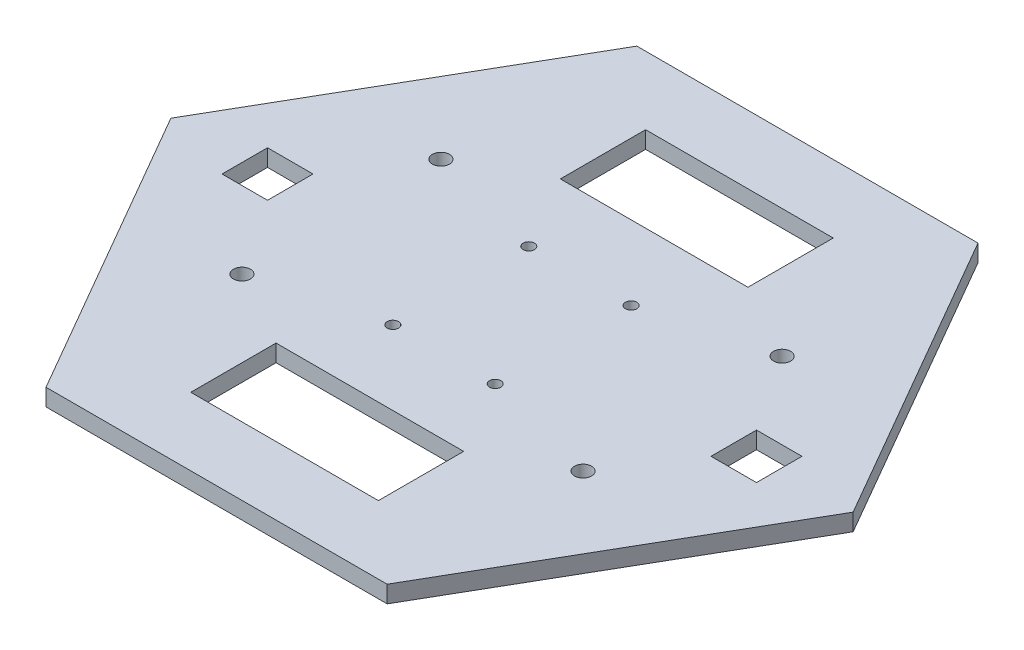
ISO-10303-21;
HEADER;
FILE_DESCRIPTION(('STEP AP214'),'2;1');
FILE_NAME('part.step','',(''),(''),'','','');
FILE_SCHEMA(('AUTOMOTIVE_DESIGN { 1 0 10303 214 1 1 1 1 }'));
ENDSEC;
DATA;
#1=APPLICATION_CONTEXT('core data for automotive mechanical design processes');
#2=APPLICATION_PROTOCOL_DEFINITION('international standard','automotive_design',2000,#1);
#3=PRODUCT_CONTEXT('',#1,'mechanical');
#4=PRODUCT('Part','Part','',(#3));
#5=PRODUCT_RELATED_PRODUCT_CATEGORY('part','',(#4));
#6=PRODUCT_DEFINITION_FORMATION('','',#4);
#7=PRODUCT_DEFINITION_CONTEXT('part definition',#1,'design');
#8=PRODUCT_DEFINITION('design','',#6,#7);
#9=PRODUCT_DEFINITION_SHAPE('','',#8);
#10=(LENGTH_UNIT() NAMED_UNIT(*) SI_UNIT(.MILLI.,.METRE.));
#11=(NAMED_UNIT(*) PLANE_ANGLE_UNIT() SI_UNIT($,.RADIAN.));
#12=(NAMED_UNIT(*) SI_UNIT($,.STERADIAN.) SOLID_ANGLE_UNIT());
#13=UNCERTAINTY_MEASURE_WITH_UNIT(LENGTH_MEASURE(1.E-05),#10,'distance_accuracy_value','');
#14=(GEOMETRIC_REPRESENTATION_CONTEXT(3) GLOBAL_UNCERTAINTY_ASSIGNED_CONTEXT((#13)) GLOBAL_UNIT_ASSIGNED_CONTEXT((#10,
#11,#12)) REPRESENTATION_CONTEXT('',''));
#15=CARTESIAN_POINT('',(0.,0.,0.));
#16=DIRECTION('',(0.,0.,1.));
#17=DIRECTION('',(1.,0.,0.));
#18=AXIS2_PLACEMENT_3D('',#15,#16,#17);
#19=CARTESIAN_POINT('',(-30.0000000000006,3.,-51.961524227066));
#20=DIRECTION('',(0.866025403784441,0.,0.499999999999995));
#21=DIRECTION('',(0.499999999999995,0.,-0.866025403784442));
#22=AXIS2_PLACEMENT_3D('',#19,#20,#21);
#23=PLANE('',#22);
#24=DIRECTION('',(-0.499999999999995,0.,0.866025403784442));
#25=VECTOR('',#24,1.);
#26=CARTESIAN_POINT('',(-30.0000000000006,0.,-51.961524227066));
#27=LINE('',#26,#25);
#28=CARTESIAN_POINT('',(-30.0000000000006,0.,-51.961524227066));
#29=VERTEX_POINT('',#28);
#30=CARTESIAN_POINT('',(-60.,0.,0.));
#31=VERTEX_POINT('',#30);
#32=EDGE_CURVE('E353',#29,#31,#27,.T.);
#33=ORIENTED_EDGE('',*,*,#32,.T.);
#34=DIRECTION('',(0.,-1.,0.));
#35=VECTOR('',#34,1.);
#36=CARTESIAN_POINT('',(-60.,3.,0.));
#37=LINE('',#36,#35);
#38=CARTESIAN_POINT('',(-60.,3.,0.));
#39=VERTEX_POINT('',#38);
#40=EDGE_CURVE('E11',#39,#31,#37,.T.);
#41=ORIENTED_EDGE('',*,*,#40,.F.);
#42=DIRECTION('',(-0.499999999999995,0.,0.866025403784442));
#43=VECTOR('',#42,1.);
#44=CARTESIAN_POINT('',(-30.0000000000006,3.,-51.961524227066));
#45=LINE('',#44,#43);
#46=CARTESIAN_POINT('',(-30.0000000000006,3.,-51.961524227066));
#47=VERTEX_POINT('',#46);
#48=EDGE_CURVE('E405',#47,#39,#45,.T.);
#49=ORIENTED_EDGE('',*,*,#48,.F.);
#50=DIRECTION('',(0.,-1.,0.));
#51=VECTOR('',#50,1.);
#52=CARTESIAN_POINT('',(-30.0000000000006,3.,-51.961524227066));
#53=LINE('',#52,#51);
#54=EDGE_CURVE('E425',#47,#29,#53,.T.);
#55=ORIENTED_EDGE('',*,*,#54,.T.);
#56=EDGE_LOOP('',(#33,#41,#49,#55));
#57=FACE_BOUND('',#56,.T.);
#58=ADVANCED_FACE('F38',(#57),#23,.F.);
#59=CARTESIAN_POINT('',(-60.,3.,0.));
#60=DIRECTION('',(0.866025403784438,0.,-0.500000000000001));
#61=DIRECTION('',(-0.500000000000001,0.,-0.866025403784438));
#62=AXIS2_PLACEMENT_3D('',#59,#60,#61);
#63=PLANE('',#62);
#64=DIRECTION('',(0.500000000000001,0.,0.866025403784438));
#65=VECTOR('',#64,1.);
#66=CARTESIAN_POINT('',(-60.,0.,0.));
#67=LINE('',#66,#65);
#68=CARTESIAN_POINT('',(-29.9999999999999,0.,51.9615242270664));
#69=VERTEX_POINT('',#68);
#70=EDGE_CURVE('E429',#31,#69,#67,.T.);
#71=ORIENTED_EDGE('',*,*,#70,.T.);
#72=DIRECTION('',(0.,-1.,0.));
#73=VECTOR('',#72,1.);
#74=CARTESIAN_POINT('',(-29.9999999999999,3.,51.9615242270664));
#75=LINE('',#74,#73);
#76=CARTESIAN_POINT('',(-29.9999999999999,3.,51.9615242270664));
#77=VERTEX_POINT('',#76);
#78=EDGE_CURVE('E46',#77,#69,#75,.T.);
#79=ORIENTED_EDGE('',*,*,#78,.F.);
#80=DIRECTION('',(0.500000000000001,0.,0.866025403784438));
#81=VECTOR('',#80,1.);
#82=CARTESIAN_POINT('',(-60.,3.,0.));
#83=LINE('',#82,#81);
#84=EDGE_CURVE('E409',#39,#77,#83,.T.);
#85=ORIENTED_EDGE('',*,*,#84,.F.);
#86=ORIENTED_EDGE('',*,*,#40,.T.);
#87=EDGE_LOOP('',(#71,#79,#85,#86));
#88=FACE_BOUND('',#87,.T.);
#89=ADVANCED_FACE('F485',(#88),#63,.F.);
#90=CARTESIAN_POINT('',(-29.9999999999999,3.,51.9615242270664));
#91=DIRECTION('',(0.,0.,-1.));
#92=DIRECTION('',(-1.,0.,0.));
#93=AXIS2_PLACEMENT_3D('',#90,#91,#92);
#94=PLANE('',#93);
#95=DIRECTION('',(1.,0.,0.));
#96=VECTOR('',#95,1.);
#97=CARTESIAN_POINT('',(-29.9999999999999,0.,51.9615242270664));
#98=LINE('',#97,#96);
#99=CARTESIAN_POINT('',(30.0000000000002,0.,51.9615242270662));
#100=VERTEX_POINT('',#99);
#101=EDGE_CURVE('E432',#69,#100,#98,.T.);
#102=ORIENTED_EDGE('',*,*,#101,.T.);
#103=DIRECTION('',(0.,-1.,0.));
#104=VECTOR('',#103,1.);
#105=CARTESIAN_POINT('',(30.0000000000002,3.,51.9615242270662));
#106=LINE('',#105,#104);
#107=CARTESIAN_POINT('',(30.0000000000002,3.,51.9615242270662));
#108=VERTEX_POINT('',#107);
#109=EDGE_CURVE('E454',#108,#100,#106,.T.);
#110=ORIENTED_EDGE('',*,*,#109,.F.);
#111=DIRECTION('',(1.,0.,0.));
#112=VECTOR('',#111,1.);
#113=CARTESIAN_POINT('',(-29.9999999999999,3.,51.9615242270664));
#114=LINE('',#113,#112);
#115=EDGE_CURVE('E413',#77,#108,#114,.T.);
#116=ORIENTED_EDGE('',*,*,#115,.F.);
#117=ORIENTED_EDGE('',*,*,#78,.T.);
#118=EDGE_LOOP('',(#102,#110,#116,#117));
#119=FACE_BOUND('',#118,.T.);
#120=ADVANCED_FACE('F463',(#119),#94,.F.);
#121=CARTESIAN_POINT('',(30.0000000000002,3.,51.9615242270662));
#122=DIRECTION('',(-0.866025403784441,0.,-0.499999999999995));
#123=DIRECTION('',(-0.499999999999995,0.,0.866025403784442));
#124=AXIS2_PLACEMENT_3D('',#121,#122,#123);
#125=PLANE('',#124);
#126=DIRECTION('',(0.499999999999995,0.,-0.866025403784442));
#127=VECTOR('',#126,1.);
#128=CARTESIAN_POINT('',(30.0000000000002,0.,51.9615242270662));
#129=LINE('',#128,#127);
#130=CARTESIAN_POINT('',(60.,0.,-4.18977760661176E-13));
#131=VERTEX_POINT('',#130);
#132=EDGE_CURVE('E435',#100,#131,#129,.T.);
#133=ORIENTED_EDGE('',*,*,#132,.T.);
#134=DIRECTION('',(0.,-1.,0.));
#135=VECTOR('',#134,1.);
#136=CARTESIAN_POINT('',(60.,3.,-4.18977760661176E-13));
#137=LINE('',#136,#135);
#138=CARTESIAN_POINT('',(60.,3.,-4.18977760661176E-13));
#139=VERTEX_POINT('',#138);
#140=EDGE_CURVE('E450',#139,#131,#137,.T.);
#141=ORIENTED_EDGE('',*,*,#140,.F.);
#142=DIRECTION('',(0.499999999999995,0.,-0.866025403784442));
#143=VECTOR('',#142,1.);
#144=CARTESIAN_POINT('',(30.0000000000002,3.,51.9615242270662));
#145=LINE('',#144,#143);
#146=EDGE_CURVE('E416',#108,#139,#145,.T.);
#147=ORIENTED_EDGE('',*,*,#146,.F.);
#148=ORIENTED_EDGE('',*,*,#109,.T.);
#149=EDGE_LOOP('',(#133,#141,#147,#148));
#150=FACE_BOUND('',#149,.T.);
#151=ADVANCED_FACE('F473',(#150),#125,.F.);
#152=CARTESIAN_POINT('',(60.,3.,-4.18977760661176E-13));
#153=DIRECTION('',(-0.866025403784435,0.,0.500000000000007));
#154=DIRECTION('',(0.500000000000007,0.,0.866025403784434));
#155=AXIS2_PLACEMENT_3D('',#152,#153,#154);
#156=PLANE('',#155);
#157=DIRECTION('',(-0.500000000000007,0.,-0.866025403784435));
#158=VECTOR('',#157,1.);
#159=CARTESIAN_POINT('',(60.,0.,-4.18977760661176E-13));
#160=LINE('',#159,#158);
#161=CARTESIAN_POINT('',(29.9999999999995,0.,-51.9615242270666));
#162=VERTEX_POINT('',#161);
#163=EDGE_CURVE('E438',#131,#162,#160,.T.);
#164=ORIENTED_EDGE('',*,*,#163,.T.);
#165=DIRECTION('',(0.,-1.,0.));
#166=VECTOR('',#165,1.);
#167=CARTESIAN_POINT('',(29.9999999999995,3.,-51.9615242270666));
#168=LINE('',#167,#166);
#169=CARTESIAN_POINT('',(29.9999999999995,3.,-51.9615242270666));
#170=VERTEX_POINT('',#169);
#171=EDGE_CURVE('E446',#170,#162,#168,.T.);
#172=ORIENTED_EDGE('',*,*,#171,.F.);
#173=DIRECTION('',(-0.500000000000007,0.,-0.866025403784435));
#174=VECTOR('',#173,1.);
#175=CARTESIAN_POINT('',(60.,3.,-4.18977760661176E-13));
#176=LINE('',#175,#174);
#177=EDGE_CURVE('E419',#139,#170,#176,.T.);
#178=ORIENTED_EDGE('',*,*,#177,.F.);
#179=ORIENTED_EDGE('',*,*,#140,.T.);
#180=EDGE_LOOP('',(#164,#172,#178,#179));
#181=FACE_BOUND('',#180,.T.);
#182=ADVANCED_FACE('F477',(#181),#156,.F.);
#183=CARTESIAN_POINT('',(29.9999999999995,3.,-51.9615242270666));
#184=DIRECTION('',(0.,0.,1.));
#185=DIRECTION('',(1.,0.,0.));
#186=AXIS2_PLACEMENT_3D('',#183,#184,#185);
#187=PLANE('',#186);
#188=DIRECTION('',(-1.,0.,0.));
#189=VECTOR('',#188,1.);
#190=CARTESIAN_POINT('',(29.9999999999995,0.,-51.9615242270666));
#191=LINE('',#190,#189);
#192=EDGE_CURVE('E410',#162,#29,#191,.T.);
#193=ORIENTED_EDGE('',*,*,#192,.T.);
#194=ORIENTED_EDGE('',*,*,#54,.F.);
#195=DIRECTION('',(-1.,0.,0.));
#196=VECTOR('',#195,1.);
#197=CARTESIAN_POINT('',(29.9999999999995,3.,-51.9615242270666));
#198=LINE('',#197,#196);
#199=EDGE_CURVE('E422',#170,#47,#198,.T.);
#200=ORIENTED_EDGE('',*,*,#199,.F.);
#201=ORIENTED_EDGE('',*,*,#171,.T.);
#202=EDGE_LOOP('',(#193,#194,#200,#201));
#203=FACE_BOUND('',#202,.T.);
#204=ADVANCED_FACE('F488',(#203),#187,.F.);
#205=CARTESIAN_POINT('',(0.,3.,0.));
#206=DIRECTION('',(0.,1.,0.));
#207=DIRECTION('',(0.,0.,1.));
#208=AXIS2_PLACEMENT_3D('',#205,#206,#207);
#209=PLANE('',#208);
#210=CARTESIAN_POINT('',(30.,3.,17.5));
#211=DIRECTION('',(0.,1.,0.));
#212=DIRECTION('',(0.,0.,1.));
#213=AXIS2_PLACEMENT_3D('',#210,#211,#212);
#214=CIRCLE('',#213,1.50000000000001);
#215=CARTESIAN_POINT('',(30.,3.,19.));
#216=VERTEX_POINT('',#215);
#217=EDGE_CURVE('E776',#216,#216,#214,.T.);
#218=ORIENTED_EDGE('',*,*,#217,.F.);
#219=EDGE_LOOP('',(#218));
#220=FACE_BOUND('',#219,.T.);
#221=CARTESIAN_POINT('',(30.,3.,-17.5));
#222=DIRECTION('',(0.,1.,0.));
#223=DIRECTION('',(0.,0.,1.));
#224=AXIS2_PLACEMENT_3D('',#221,#222,#223);
#225=CIRCLE('',#224,1.50000000000001);
#226=CARTESIAN_POINT('',(30.,3.,-16.));
#227=VERTEX_POINT('',#226);
#228=EDGE_CURVE('E780',#227,#227,#225,.T.);
#229=ORIENTED_EDGE('',*,*,#228,.F.);
#230=EDGE_LOOP('',(#229));
#231=FACE_BOUND('',#230,.T.);
#232=CARTESIAN_POINT('',(-30.,3.,-17.5));
#233=DIRECTION('',(0.,1.,0.));
#234=DIRECTION('',(0.,0.,1.));
#235=AXIS2_PLACEMENT_3D('',#232,#233,#234);
#236=CIRCLE('',#235,1.5);
#237=CARTESIAN_POINT('',(-30.,3.,-16.));
#238=VERTEX_POINT('',#237);
#239=EDGE_CURVE('E794',#238,#238,#236,.T.);
#240=ORIENTED_EDGE('',*,*,#239,.F.);
#241=EDGE_LOOP('',(#240));
#242=FACE_BOUND('',#241,.T.);
#243=CARTESIAN_POINT('',(-30.,3.,17.5));
#244=DIRECTION('',(0.,1.,0.));
#245=DIRECTION('',(0.,0.,1.));
#246=AXIS2_PLACEMENT_3D('',#243,#244,#245);
#247=CIRCLE('',#246,1.5);
#248=CARTESIAN_POINT('',(-30.,3.,19.));
#249=VERTEX_POINT('',#248);
#250=EDGE_CURVE('E218',#249,#249,#247,.T.);
#251=ORIENTED_EDGE('',*,*,#250,.F.);
#252=EDGE_LOOP('',(#251));
#253=FACE_BOUND('',#252,.T.);
#254=DIRECTION('',(0.,0.,-1.));
#255=VECTOR('',#254,1.);
#256=CARTESIAN_POINT('',(-39.,3.,-3.99999999999999));
#257=LINE('',#256,#255);
#258=CARTESIAN_POINT('',(-39.,3.,4.00000000000001));
#259=VERTEX_POINT('',#258);
#260=CARTESIAN_POINT('',(-39.,3.,-3.99999999999999));
#261=VERTEX_POINT('',#260);
#262=EDGE_CURVE('E53',#259,#261,#257,.T.);
#263=ORIENTED_EDGE('',*,*,#262,.F.);
#264=DIRECTION('',(1.,0.,0.));
#265=VECTOR('',#264,1.);
#266=CARTESIAN_POINT('',(-47.,3.,4.00000000000001));
#267=LINE('',#266,#265);
#268=CARTESIAN_POINT('',(-47.,3.,4.00000000000001));
#269=VERTEX_POINT('',#268);
#270=EDGE_CURVE('E211',#269,#259,#267,.T.);
#271=ORIENTED_EDGE('',*,*,#270,.F.);
#272=DIRECTION('',(0.,0.,1.));
#273=VECTOR('',#272,1.);
#274=CARTESIAN_POINT('',(-47.,3.,-3.99999999999999));
#275=LINE('',#274,#273);
#276=CARTESIAN_POINT('',(-47.,3.,-3.99999999999999));
#277=VERTEX_POINT('',#276);
#278=EDGE_CURVE('E215',#277,#269,#275,.T.);
#279=ORIENTED_EDGE('',*,*,#278,.F.);
#280=DIRECTION('',(-1.,0.,0.));
#281=VECTOR('',#280,1.);
#282=CARTESIAN_POINT('',(-47.,3.,-3.99999999999999));
#283=LINE('',#282,#281);
#284=EDGE_CURVE('E227',#261,#277,#283,.T.);
#285=ORIENTED_EDGE('',*,*,#284,.F.);
#286=EDGE_LOOP('',(#263,#271,#279,#285));
#287=FACE_BOUND('',#286,.T.);
#288=DIRECTION('',(0.,0.,-1.));
#289=VECTOR('',#288,1.);
#290=CARTESIAN_POINT('',(47.,3.,-3.99999999999999));
#291=LINE('',#290,#289);
#292=CARTESIAN_POINT('',(47.,3.,4.00000000000001));
#293=VERTEX_POINT('',#292);
#294=CARTESIAN_POINT('',(47.,3.,-3.99999999999999));
#295=VERTEX_POINT('',#294);
#296=EDGE_CURVE('E61',#293,#295,#291,.T.);
#297=ORIENTED_EDGE('',*,*,#296,.F.);
#298=DIRECTION('',(1.,0.,0.));
#299=VECTOR('',#298,1.);
#300=CARTESIAN_POINT('',(47.,3.,4.00000000000001));
#301=LINE('',#300,#299);
#302=CARTESIAN_POINT('',(39.,3.,4.00000000000001));
#303=VERTEX_POINT('',#302);
#304=EDGE_CURVE('E248',#303,#293,#301,.T.);
#305=ORIENTED_EDGE('',*,*,#304,.F.);
#306=DIRECTION('',(0.,0.,1.));
#307=VECTOR('',#306,1.);
#308=CARTESIAN_POINT('',(39.,3.,-3.99999999999999));
#309=LINE('',#308,#307);
#310=CARTESIAN_POINT('',(39.,3.,-3.99999999999999));
#311=VERTEX_POINT('',#310);
#312=EDGE_CURVE('E268',#311,#303,#309,.T.);
#313=ORIENTED_EDGE('',*,*,#312,.F.);
#314=DIRECTION('',(-1.,0.,0.));
#315=VECTOR('',#314,1.);
#316=CARTESIAN_POINT('',(47.,3.,-3.99999999999999));
#317=LINE('',#316,#315);
#318=EDGE_CURVE('E263',#295,#311,#317,.T.);
#319=ORIENTED_EDGE('',*,*,#318,.F.);
#320=EDGE_LOOP('',(#297,#305,#313,#319));
#321=FACE_BOUND('',#320,.T.);
#322=CARTESIAN_POINT('',(-9.,3.,-11.95));
#323=DIRECTION('',(0.,1.,0.));
#324=DIRECTION('',(0.,0.,-1.));
#325=AXIS2_PLACEMENT_3D('',#322,#323,#324);
#326=CIRCLE('',#325,1.);
#327=CARTESIAN_POINT('',(-9.,3.,-12.95));
#328=VERTEX_POINT('',#327);
#329=EDGE_CURVE('E237',#328,#328,#326,.T.);
#330=ORIENTED_EDGE('',*,*,#329,.F.);
#331=EDGE_LOOP('',(#330));
#332=FACE_BOUND('',#331,.T.);
#333=CARTESIAN_POINT('',(9.,3.,-11.95));
#334=DIRECTION('',(0.,1.,0.));
#335=DIRECTION('',(0.,0.,-1.));
#336=AXIS2_PLACEMENT_3D('',#333,#334,#335);
#337=CIRCLE('',#336,1.);
#338=CARTESIAN_POINT('',(9.,3.,-12.95));
#339=VERTEX_POINT('',#338);
#340=EDGE_CURVE('E298',#339,#339,#337,.T.);
#341=ORIENTED_EDGE('',*,*,#340,.F.);
#342=EDGE_LOOP('',(#341));
#343=FACE_BOUND('',#342,.T.);
#344=CARTESIAN_POINT('',(9.,3.,11.95));
#345=DIRECTION('',(0.,1.,0.));
#346=DIRECTION('',(0.,0.,1.));
#347=AXIS2_PLACEMENT_3D('',#344,#345,#346);
#348=CIRCLE('',#347,1.);
#349=CARTESIAN_POINT('',(9.,3.,12.95));
#350=VERTEX_POINT('',#349);
#351=EDGE_CURVE('E290',#350,#350,#348,.T.);
#352=ORIENTED_EDGE('',*,*,#351,.F.);
#353=EDGE_LOOP('',(#352));
#354=FACE_BOUND('',#353,.T.);
#355=CARTESIAN_POINT('',(-9.,3.,11.95));
#356=DIRECTION('',(0.,1.,0.));
#357=DIRECTION('',(0.,0.,1.));
#358=AXIS2_PLACEMENT_3D('',#355,#356,#357);
#359=CIRCLE('',#358,1.);
#360=CARTESIAN_POINT('',(-9.,3.,12.95));
#361=VERTEX_POINT('',#360);
#362=EDGE_CURVE('E289',#361,#361,#359,.T.);
#363=ORIENTED_EDGE('',*,*,#362,.F.);
#364=EDGE_LOOP('',(#363));
#365=FACE_BOUND('',#364,.T.);
#366=DIRECTION('',(0.,0.,-1.));
#367=VECTOR('',#366,1.);
#368=CARTESIAN_POINT('',(16.5,3.,25.));
#369=LINE('',#368,#367);
#370=CARTESIAN_POINT('',(16.5,3.,40.));
#371=VERTEX_POINT('',#370);
#372=CARTESIAN_POINT('',(16.5,3.,25.));
#373=VERTEX_POINT('',#372);
#374=EDGE_CURVE('E335',#371,#373,#369,.T.);
#375=ORIENTED_EDGE('',*,*,#374,.F.);
#376=DIRECTION('',(1.,0.,0.));
#377=VECTOR('',#376,1.);
#378=CARTESIAN_POINT('',(-16.5,3.,40.));
#379=LINE('',#378,#377);
#380=CARTESIAN_POINT('',(-16.5,3.,40.));
#381=VERTEX_POINT('',#380);
#382=EDGE_CURVE('E322',#381,#371,#379,.T.);
#383=ORIENTED_EDGE('',*,*,#382,.F.);
#384=DIRECTION('',(0.,0.,1.));
#385=VECTOR('',#384,1.);
#386=CARTESIAN_POINT('',(-16.5,3.,25.));
#387=LINE('',#386,#385);
#388=CARTESIAN_POINT('',(-16.5,3.,25.));
#389=VERTEX_POINT('',#388);
#390=EDGE_CURVE('E343',#389,#381,#387,.T.);
#391=ORIENTED_EDGE('',*,*,#390,.F.);
#392=DIRECTION('',(-1.,0.,0.));
#393=VECTOR('',#392,1.);
#394=CARTESIAN_POINT('',(-16.5,3.,25.));
#395=LINE('',#394,#393);
#396=EDGE_CURVE('E338',#373,#389,#395,.T.);
#397=ORIENTED_EDGE('',*,*,#396,.F.);
#398=EDGE_LOOP('',(#375,#383,#391,#397));
#399=FACE_BOUND('',#398,.T.);
#400=DIRECTION('',(0.,0.,-1.));
#401=VECTOR('',#400,1.);
#402=CARTESIAN_POINT('',(16.5,3.,-40.));
#403=LINE('',#402,#401);
#404=CARTESIAN_POINT('',(16.5,3.,-25.));
#405=VERTEX_POINT('',#404);
#406=CARTESIAN_POINT('',(16.5,3.,-40.));
#407=VERTEX_POINT('',#406);
#408=EDGE_CURVE('E313',#405,#407,#403,.T.);
#409=ORIENTED_EDGE('',*,*,#408,.F.);
#410=DIRECTION('',(1.,0.,0.));
#411=VECTOR('',#410,1.);
#412=CARTESIAN_POINT('',(-16.5,3.,-25.));
#413=LINE('',#412,#411);
#414=CARTESIAN_POINT('',(-16.5,3.,-25.));
#415=VERTEX_POINT('',#414);
#416=EDGE_CURVE('E368',#415,#405,#413,.T.);
#417=ORIENTED_EDGE('',*,*,#416,.F.);
#418=DIRECTION('',(0.,0.,1.));
#419=VECTOR('',#418,1.);
#420=CARTESIAN_POINT('',(-16.5,3.,-40.));
#421=LINE('',#420,#419);
#422=CARTESIAN_POINT('',(-16.5,3.,-40.));
#423=VERTEX_POINT('',#422);
#424=EDGE_CURVE('E387',#423,#415,#421,.T.);
#425=ORIENTED_EDGE('',*,*,#424,.F.);
#426=DIRECTION('',(-1.,0.,0.));
#427=VECTOR('',#426,1.);
#428=CARTESIAN_POINT('',(-16.5,3.,-40.));
#429=LINE('',#428,#427);
#430=EDGE_CURVE('E383',#407,#423,#429,.T.);
#431=ORIENTED_EDGE('',*,*,#430,.F.);
#432=EDGE_LOOP('',(#409,#417,#425,#431));
#433=FACE_BOUND('',#432,.T.);
#434=ORIENTED_EDGE('',*,*,#48,.T.);
#435=ORIENTED_EDGE('',*,*,#84,.T.);
#436=ORIENTED_EDGE('',*,*,#115,.T.);
#437=ORIENTED_EDGE('',*,*,#146,.T.);
#438=ORIENTED_EDGE('',*,*,#177,.T.);
#439=ORIENTED_EDGE('',*,*,#199,.T.);
#440=EDGE_LOOP('',(#434,#435,#436,#437,#438,#439));
#441=FACE_BOUND('',#440,.T.);
#442=ADVANCED_FACE('F481',(#220,#231,#242,#253,#287,#321,#332,#343,#354,#365,#399,#433,#441),
#209,.T.);
#443=CARTESIAN_POINT('',(0.,0.,0.));
#444=DIRECTION('',(0.,1.,0.));
#445=DIRECTION('',(0.,0.,1.));
#446=AXIS2_PLACEMENT_3D('',#443,#444,#445);
#447=PLANE('',#446);
#448=CARTESIAN_POINT('',(30.,0.,17.5));
#449=DIRECTION('',(0.,1.,0.));
#450=DIRECTION('',(0.,0.,1.));
#451=AXIS2_PLACEMENT_3D('',#448,#449,#450);
#452=CIRCLE('',#451,1.50000000000001);
#453=CARTESIAN_POINT('',(30.,0.,19.));
#454=VERTEX_POINT('',#453);
#455=EDGE_CURVE('E773',#454,#454,#452,.T.);
#456=ORIENTED_EDGE('',*,*,#455,.T.);
#457=EDGE_LOOP('',(#456));
#458=FACE_BOUND('',#457,.T.);
#459=CARTESIAN_POINT('',(30.,0.,-17.5));
#460=DIRECTION('',(0.,1.,0.));
#461=DIRECTION('',(0.,0.,1.));
#462=AXIS2_PLACEMENT_3D('',#459,#460,#461);
#463=CIRCLE('',#462,1.50000000000001);
#464=CARTESIAN_POINT('',(30.,0.,-16.));
#465=VERTEX_POINT('',#464);
#466=EDGE_CURVE('E800',#465,#465,#463,.T.);
#467=ORIENTED_EDGE('',*,*,#466,.T.);
#468=EDGE_LOOP('',(#467));
#469=FACE_BOUND('',#468,.T.);
#470=CARTESIAN_POINT('',(-30.,0.,-17.5));
#471=DIRECTION('',(0.,1.,0.));
#472=DIRECTION('',(0.,0.,1.));
#473=AXIS2_PLACEMENT_3D('',#470,#471,#472);
#474=CIRCLE('',#473,1.5);
#475=CARTESIAN_POINT('',(-30.,0.,-16.));
#476=VERTEX_POINT('',#475);
#477=EDGE_CURVE('E789',#476,#476,#474,.T.);
#478=ORIENTED_EDGE('',*,*,#477,.T.);
#479=EDGE_LOOP('',(#478));
#480=FACE_BOUND('',#479,.T.);
#481=CARTESIAN_POINT('',(-30.,0.,17.5));
#482=DIRECTION('',(0.,1.,0.));
#483=DIRECTION('',(0.,0.,1.));
#484=AXIS2_PLACEMENT_3D('',#481,#482,#483);
#485=CIRCLE('',#484,1.5);
#486=CARTESIAN_POINT('',(-30.,0.,19.));
#487=VERTEX_POINT('',#486);
#488=EDGE_CURVE('E264',#487,#487,#485,.T.);
#489=ORIENTED_EDGE('',*,*,#488,.T.);
#490=EDGE_LOOP('',(#489));
#491=FACE_BOUND('',#490,.T.);
#492=DIRECTION('',(1.,0.,0.));
#493=VECTOR('',#492,1.);
#494=CARTESIAN_POINT('',(-47.,0.,4.00000000000001));
#495=LINE('',#494,#493);
#496=CARTESIAN_POINT('',(-47.,0.,4.00000000000001));
#497=VERTEX_POINT('',#496);
#498=CARTESIAN_POINT('',(-39.,0.,4.00000000000001));
#499=VERTEX_POINT('',#498);
#500=EDGE_CURVE('E196',#497,#499,#495,.T.);
#501=ORIENTED_EDGE('',*,*,#500,.T.);
#502=DIRECTION('',(0.,0.,-1.));
#503=VECTOR('',#502,1.);
#504=CARTESIAN_POINT('',(-39.,0.,-3.99999999999999));
#505=LINE('',#504,#503);
#506=CARTESIAN_POINT('',(-39.,0.,-3.99999999999999));
#507=VERTEX_POINT('',#506);
#508=EDGE_CURVE('E189',#499,#507,#505,.T.);
#509=ORIENTED_EDGE('',*,*,#508,.T.);
#510=DIRECTION('',(-1.,0.,0.));
#511=VECTOR('',#510,1.);
#512=CARTESIAN_POINT('',(-47.,0.,-3.99999999999999));
#513=LINE('',#512,#511);
#514=CARTESIAN_POINT('',(-47.,0.,-3.99999999999999));
#515=VERTEX_POINT('',#514);
#516=EDGE_CURVE('E200',#507,#515,#513,.T.);
#517=ORIENTED_EDGE('',*,*,#516,.T.);
#518=DIRECTION('',(0.,0.,1.));
#519=VECTOR('',#518,1.);
#520=CARTESIAN_POINT('',(-47.,0.,-3.99999999999999));
#521=LINE('',#520,#519);
#522=EDGE_CURVE('E205',#515,#497,#521,.T.);
#523=ORIENTED_EDGE('',*,*,#522,.T.);
#524=EDGE_LOOP('',(#501,#509,#517,#523));
#525=FACE_BOUND('',#524,.T.);
#526=DIRECTION('',(1.,0.,0.));
#527=VECTOR('',#526,1.);
#528=CARTESIAN_POINT('',(47.,0.,4.00000000000001));
#529=LINE('',#528,#527);
#530=CARTESIAN_POINT('',(39.,0.,4.00000000000001));
#531=VERTEX_POINT('',#530);
#532=CARTESIAN_POINT('',(47.,0.,4.00000000000001));
#533=VERTEX_POINT('',#532);
#534=EDGE_CURVE('E256',#531,#533,#529,.T.);
#535=ORIENTED_EDGE('',*,*,#534,.T.);
#536=DIRECTION('',(0.,0.,-1.));
#537=VECTOR('',#536,1.);
#538=CARTESIAN_POINT('',(47.,0.,-3.99999999999999));
#539=LINE('',#538,#537);
#540=CARTESIAN_POINT('',(47.,0.,-3.99999999999999));
#541=VERTEX_POINT('',#540);
#542=EDGE_CURVE('E243',#533,#541,#539,.T.);
#543=ORIENTED_EDGE('',*,*,#542,.T.);
#544=DIRECTION('',(-1.,0.,0.));
#545=VECTOR('',#544,1.);
#546=CARTESIAN_POINT('',(47.,0.,-3.99999999999999));
#547=LINE('',#546,#545);
#548=CARTESIAN_POINT('',(39.,0.,-3.99999999999999));
#549=VERTEX_POINT('',#548);
#550=EDGE_CURVE('E247',#541,#549,#547,.T.);
#551=ORIENTED_EDGE('',*,*,#550,.T.);
#552=DIRECTION('',(0.,0.,1.));
#553=VECTOR('',#552,1.);
#554=CARTESIAN_POINT('',(39.,0.,-3.99999999999999));
#555=LINE('',#554,#553);
#556=EDGE_CURVE('E252',#549,#531,#555,.T.);
#557=ORIENTED_EDGE('',*,*,#556,.T.);
#558=EDGE_LOOP('',(#535,#543,#551,#557));
#559=FACE_BOUND('',#558,.T.);
#560=CARTESIAN_POINT('',(-9.,0.,-11.95));
#561=DIRECTION('',(0.,1.,0.));
#562=DIRECTION('',(0.,0.,-1.));
#563=AXIS2_PLACEMENT_3D('',#560,#561,#562);
#564=CIRCLE('',#563,1.);
#565=CARTESIAN_POINT('',(-9.,0.,-12.95));
#566=VERTEX_POINT('',#565);
#567=EDGE_CURVE('E302',#566,#566,#564,.T.);
#568=ORIENTED_EDGE('',*,*,#567,.T.);
#569=EDGE_LOOP('',(#568));
#570=FACE_BOUND('',#569,.T.);
#571=CARTESIAN_POINT('',(9.,0.,-11.95));
#572=DIRECTION('',(0.,1.,0.));
#573=DIRECTION('',(0.,0.,-1.));
#574=AXIS2_PLACEMENT_3D('',#571,#572,#573);
#575=CIRCLE('',#574,1.);
#576=CARTESIAN_POINT('',(9.,0.,-12.95));
#577=VERTEX_POINT('',#576);
#578=EDGE_CURVE('E294',#577,#577,#575,.T.);
#579=ORIENTED_EDGE('',*,*,#578,.T.);
#580=EDGE_LOOP('',(#579));
#581=FACE_BOUND('',#580,.T.);
#582=CARTESIAN_POINT('',(9.,0.,11.95));
#583=DIRECTION('',(0.,1.,0.));
#584=DIRECTION('',(0.,0.,1.));
#585=AXIS2_PLACEMENT_3D('',#582,#583,#584);
#586=CIRCLE('',#585,1.);
#587=CARTESIAN_POINT('',(9.,0.,12.95));
#588=VERTEX_POINT('',#587);
#589=EDGE_CURVE('E285',#588,#588,#586,.T.);
#590=ORIENTED_EDGE('',*,*,#589,.T.);
#591=EDGE_LOOP('',(#590));
#592=FACE_BOUND('',#591,.T.);
#593=CARTESIAN_POINT('',(-9.,0.,11.95));
#594=DIRECTION('',(0.,1.,0.));
#595=DIRECTION('',(0.,0.,1.));
#596=AXIS2_PLACEMENT_3D('',#593,#594,#595);
#597=CIRCLE('',#596,1.);
#598=CARTESIAN_POINT('',(-9.,0.,12.95));
#599=VERTEX_POINT('',#598);
#600=EDGE_CURVE('E309',#599,#599,#597,.T.);
#601=ORIENTED_EDGE('',*,*,#600,.T.);
#602=EDGE_LOOP('',(#601));
#603=FACE_BOUND('',#602,.T.);
#604=DIRECTION('',(1.,0.,0.));
#605=VECTOR('',#604,1.);
#606=CARTESIAN_POINT('',(-16.5,0.,40.));
#607=LINE('',#606,#605);
#608=CARTESIAN_POINT('',(-16.5,0.,40.));
#609=VERTEX_POINT('',#608);
#610=CARTESIAN_POINT('',(16.5,0.,40.));
#611=VERTEX_POINT('',#610);
#612=EDGE_CURVE('E330',#609,#611,#607,.T.);
#613=ORIENTED_EDGE('',*,*,#612,.T.);
#614=DIRECTION('',(0.,0.,-1.));
#615=VECTOR('',#614,1.);
#616=CARTESIAN_POINT('',(16.5,0.,25.));
#617=LINE('',#616,#615);
#618=CARTESIAN_POINT('',(16.5,0.,25.));
#619=VERTEX_POINT('',#618);
#620=EDGE_CURVE('E317',#611,#619,#617,.T.);
#621=ORIENTED_EDGE('',*,*,#620,.T.);
#622=DIRECTION('',(-1.,0.,0.));
#623=VECTOR('',#622,1.);
#624=CARTESIAN_POINT('',(-16.5,0.,25.));
#625=LINE('',#624,#623);
#626=CARTESIAN_POINT('',(-16.5,0.,25.));
#627=VERTEX_POINT('',#626);
#628=EDGE_CURVE('E321',#619,#627,#625,.T.);
#629=ORIENTED_EDGE('',*,*,#628,.T.);
#630=DIRECTION('',(0.,0.,1.));
#631=VECTOR('',#630,1.);
#632=CARTESIAN_POINT('',(-16.5,0.,25.));
#633=LINE('',#632,#631);
#634=EDGE_CURVE('E326',#627,#609,#633,.T.);
#635=ORIENTED_EDGE('',*,*,#634,.T.);
#636=EDGE_LOOP('',(#613,#621,#629,#635));
#637=FACE_BOUND('',#636,.T.);
#638=DIRECTION('',(1.,0.,0.));
#639=VECTOR('',#638,1.);
#640=CARTESIAN_POINT('',(-16.5,0.,-25.));
#641=LINE('',#640,#639);
#642=CARTESIAN_POINT('',(-16.5,0.,-25.));
#643=VERTEX_POINT('',#642);
#644=CARTESIAN_POINT('',(16.5,0.,-25.));
#645=VERTEX_POINT('',#644);
#646=EDGE_CURVE('E376',#643,#645,#641,.T.);
#647=ORIENTED_EDGE('',*,*,#646,.T.);
#648=DIRECTION('',(0.,0.,-1.));
#649=VECTOR('',#648,1.);
#650=CARTESIAN_POINT('',(16.5,0.,-40.));
#651=LINE('',#650,#649);
#652=CARTESIAN_POINT('',(16.5,0.,-40.));
#653=VERTEX_POINT('',#652);
#654=EDGE_CURVE('E363',#645,#653,#651,.T.);
#655=ORIENTED_EDGE('',*,*,#654,.T.);
#656=DIRECTION('',(-1.,0.,0.));
#657=VECTOR('',#656,1.);
#658=CARTESIAN_POINT('',(-16.5,0.,-40.));
#659=LINE('',#658,#657);
#660=CARTESIAN_POINT('',(-16.5,0.,-40.));
#661=VERTEX_POINT('',#660);
#662=EDGE_CURVE('E367',#653,#661,#659,.T.);
#663=ORIENTED_EDGE('',*,*,#662,.T.);
#664=DIRECTION('',(0.,0.,1.));
#665=VECTOR('',#664,1.);
#666=CARTESIAN_POINT('',(-16.5,0.,-40.));
#667=LINE('',#666,#665);
#668=EDGE_CURVE('E372',#661,#643,#667,.T.);
#669=ORIENTED_EDGE('',*,*,#668,.T.);
#670=EDGE_LOOP('',(#647,#655,#663,#669));
#671=FACE_BOUND('',#670,.T.);
#672=ORIENTED_EDGE('',*,*,#32,.F.);
#673=ORIENTED_EDGE('',*,*,#192,.F.);
#674=ORIENTED_EDGE('',*,*,#163,.F.);
#675=ORIENTED_EDGE('',*,*,#132,.F.);
#676=ORIENTED_EDGE('',*,*,#101,.F.);
#677=ORIENTED_EDGE('',*,*,#70,.F.);
#678=EDGE_LOOP('',(#672,#673,#674,#675,#676,#677));
#679=FACE_BOUND('',#678,.T.);
#680=ADVANCED_FACE('F207',(#458,#469,#480,#491,#525,#559,#570,#581,#592,#603,#637,#671,#679),
#447,.F.);
#681=CARTESIAN_POINT('',(16.5,0.,-40.));
#682=DIRECTION('',(1.,0.,0.));
#683=DIRECTION('',(0.,0.,-1.));
#684=AXIS2_PLACEMENT_3D('',#681,#682,#683);
#685=PLANE('',#684);
#686=ORIENTED_EDGE('',*,*,#408,.T.);
#687=DIRECTION('',(0.,1.,0.));
#688=VECTOR('',#687,1.);
#689=CARTESIAN_POINT('',(16.5,0.,-40.));
#690=LINE('',#689,#688);
#691=EDGE_CURVE('E380',#653,#407,#690,.T.);
#692=ORIENTED_EDGE('',*,*,#691,.F.);
#693=ORIENTED_EDGE('',*,*,#654,.F.);
#694=DIRECTION('',(0.,1.,0.));
#695=VECTOR('',#694,1.);
#696=CARTESIAN_POINT('',(16.5,0.,-25.));
#697=LINE('',#696,#695);
#698=EDGE_CURVE('E339',#645,#405,#697,.T.);
#699=ORIENTED_EDGE('',*,*,#698,.T.);
#700=EDGE_LOOP('',(#686,#692,#693,#699));
#701=FACE_BOUND('',#700,.T.);
#702=ADVANCED_FACE('F528',(#701),#685,.F.);
#703=CARTESIAN_POINT('',(-16.5,0.,-25.));
#704=DIRECTION('',(0.,0.,1.));
#705=DIRECTION('',(1.,0.,0.));
#706=AXIS2_PLACEMENT_3D('',#703,#704,#705);
#707=PLANE('',#706);
#708=ORIENTED_EDGE('',*,*,#416,.T.);
#709=ORIENTED_EDGE('',*,*,#698,.F.);
#710=ORIENTED_EDGE('',*,*,#646,.F.);
#711=DIRECTION('',(0.,1.,0.));
#712=VECTOR('',#711,1.);
#713=CARTESIAN_POINT('',(-16.5,0.,-25.));
#714=LINE('',#713,#712);
#715=EDGE_CURVE('E396',#643,#415,#714,.T.);
#716=ORIENTED_EDGE('',*,*,#715,.T.);
#717=EDGE_LOOP('',(#708,#709,#710,#716));
#718=FACE_BOUND('',#717,.T.);
#719=ADVANCED_FACE('F533',(#718),#707,.F.);
#720=CARTESIAN_POINT('',(-16.5,0.,-40.));
#721=DIRECTION('',(-1.,0.,0.));
#722=DIRECTION('',(0.,0.,1.));
#723=AXIS2_PLACEMENT_3D('',#720,#721,#722);
#724=PLANE('',#723);
#725=ORIENTED_EDGE('',*,*,#424,.T.);
#726=ORIENTED_EDGE('',*,*,#715,.F.);
#727=ORIENTED_EDGE('',*,*,#668,.F.);
#728=DIRECTION('',(0.,1.,0.));
#729=VECTOR('',#728,1.);
#730=CARTESIAN_POINT('',(-16.5,0.,-40.));
#731=LINE('',#730,#729);
#732=EDGE_CURVE('E399',#661,#423,#731,.T.);
#733=ORIENTED_EDGE('',*,*,#732,.T.);
#734=EDGE_LOOP('',(#725,#726,#727,#733));
#735=FACE_BOUND('',#734,.T.);
#736=ADVANCED_FACE('F545',(#735),#724,.F.);
#737=CARTESIAN_POINT('',(-16.5,0.,-40.));
#738=DIRECTION('',(0.,0.,-1.));
#739=DIRECTION('',(-1.,0.,0.));
#740=AXIS2_PLACEMENT_3D('',#737,#738,#739);
#741=PLANE('',#740);
#742=ORIENTED_EDGE('',*,*,#430,.T.);
#743=ORIENTED_EDGE('',*,*,#732,.F.);
#744=ORIENTED_EDGE('',*,*,#662,.F.);
#745=ORIENTED_EDGE('',*,*,#691,.T.);
#746=EDGE_LOOP('',(#742,#743,#744,#745));
#747=FACE_BOUND('',#746,.T.);
#748=ADVANCED_FACE('F555',(#747),#741,.F.);
#749=CARTESIAN_POINT('',(16.5,0.,25.));
#750=DIRECTION('',(1.,0.,0.));
#751=DIRECTION('',(0.,0.,-1.));
#752=AXIS2_PLACEMENT_3D('',#749,#750,#751);
#753=PLANE('',#752);
#754=ORIENTED_EDGE('',*,*,#374,.T.);
#755=DIRECTION('',(0.,1.,0.));
#756=VECTOR('',#755,1.);
#757=CARTESIAN_POINT('',(16.5,0.,25.));
#758=LINE('',#757,#756);
#759=EDGE_CURVE('E334',#619,#373,#758,.T.);
#760=ORIENTED_EDGE('',*,*,#759,.F.);
#761=ORIENTED_EDGE('',*,*,#620,.F.);
#762=DIRECTION('',(0.,1.,0.));
#763=VECTOR('',#762,1.);
#764=CARTESIAN_POINT('',(16.5,0.,40.));
#765=LINE('',#764,#763);
#766=EDGE_CURVE('E350',#611,#371,#765,.T.);
#767=ORIENTED_EDGE('',*,*,#766,.T.);
#768=EDGE_LOOP('',(#754,#760,#761,#767));
#769=FACE_BOUND('',#768,.T.);
#770=ADVANCED_FACE('F565',(#769),#753,.F.);
#771=CARTESIAN_POINT('',(-16.5,0.,40.));
#772=DIRECTION('',(0.,0.,1.));
#773=DIRECTION('',(1.,0.,0.));
#774=AXIS2_PLACEMENT_3D('',#771,#772,#773);
#775=PLANE('',#774);
#776=ORIENTED_EDGE('',*,*,#382,.T.);
#777=ORIENTED_EDGE('',*,*,#766,.F.);
#778=ORIENTED_EDGE('',*,*,#612,.F.);
#779=DIRECTION('',(0.,1.,0.));
#780=VECTOR('',#779,1.);
#781=CARTESIAN_POINT('',(-16.5,0.,40.));
#782=LINE('',#781,#780);
#783=EDGE_CURVE('E354',#609,#381,#782,.T.);
#784=ORIENTED_EDGE('',*,*,#783,.T.);
#785=EDGE_LOOP('',(#776,#777,#778,#784));
#786=FACE_BOUND('',#785,.T.);
#787=ADVANCED_FACE('F575',(#786),#775,.F.);
#788=CARTESIAN_POINT('',(-16.5,0.,25.));
#789=DIRECTION('',(-1.,0.,0.));
#790=DIRECTION('',(0.,0.,1.));
#791=AXIS2_PLACEMENT_3D('',#788,#789,#790);
#792=PLANE('',#791);
#793=ORIENTED_EDGE('',*,*,#390,.T.);
#794=ORIENTED_EDGE('',*,*,#783,.F.);
#795=ORIENTED_EDGE('',*,*,#634,.F.);
#796=DIRECTION('',(0.,1.,0.));
#797=VECTOR('',#796,1.);
#798=CARTESIAN_POINT('',(-16.5,0.,25.));
#799=LINE('',#798,#797);
#800=EDGE_CURVE('E357',#627,#389,#799,.T.);
#801=ORIENTED_EDGE('',*,*,#800,.T.);
#802=EDGE_LOOP('',(#793,#794,#795,#801));
#803=FACE_BOUND('',#802,.T.);
#804=ADVANCED_FACE('F585',(#803),#792,.F.);
#805=CARTESIAN_POINT('',(-16.5,0.,25.));
#806=DIRECTION('',(0.,0.,-1.));
#807=DIRECTION('',(-1.,0.,0.));
#808=AXIS2_PLACEMENT_3D('',#805,#806,#807);
#809=PLANE('',#808);
#810=ORIENTED_EDGE('',*,*,#396,.T.);
#811=ORIENTED_EDGE('',*,*,#800,.F.);
#812=ORIENTED_EDGE('',*,*,#628,.F.);
#813=ORIENTED_EDGE('',*,*,#759,.T.);
#814=EDGE_LOOP('',(#810,#811,#812,#813));
#815=FACE_BOUND('',#814,.T.);
#816=ADVANCED_FACE('F595',(#815),#809,.F.);
#817=CARTESIAN_POINT('',(-9.,0.,11.95));
#818=DIRECTION('',(0.,1.,0.));
#819=DIRECTION('',(0.,0.,1.));
#820=AXIS2_PLACEMENT_3D('',#817,#818,#819);
#821=CYLINDRICAL_SURFACE('',#820,1.);
#822=ORIENTED_EDGE('',*,*,#600,.F.);
#823=EDGE_LOOP('',(#822));
#824=FACE_BOUND('',#823,.T.);
#825=ORIENTED_EDGE('',*,*,#362,.T.);
#826=EDGE_LOOP('',(#825));
#827=FACE_BOUND('',#826,.T.);
#828=ADVANCED_FACE('F605',(#824,#827),#821,.F.);
#829=CARTESIAN_POINT('',(9.,0.,11.95));
#830=DIRECTION('',(0.,1.,0.));
#831=DIRECTION('',(0.,0.,1.));
#832=AXIS2_PLACEMENT_3D('',#829,#830,#831);
#833=CYLINDRICAL_SURFACE('',#832,1.);
#834=ORIENTED_EDGE('',*,*,#589,.F.);
#835=EDGE_LOOP('',(#834));
#836=FACE_BOUND('',#835,.T.);
#837=ORIENTED_EDGE('',*,*,#351,.T.);
#838=EDGE_LOOP('',(#837));
#839=FACE_BOUND('',#838,.T.);
#840=ADVANCED_FACE('F615',(#836,#839),#833,.F.);
#841=CARTESIAN_POINT('',(9.,0.,-11.95));
#842=DIRECTION('',(0.,1.,0.));
#843=DIRECTION('',(0.,0.,1.));
#844=AXIS2_PLACEMENT_3D('',#841,#842,#843);
#845=CYLINDRICAL_SURFACE('',#844,1.);
#846=ORIENTED_EDGE('',*,*,#578,.F.);
#847=EDGE_LOOP('',(#846));
#848=FACE_BOUND('',#847,.T.);
#849=ORIENTED_EDGE('',*,*,#340,.T.);
#850=EDGE_LOOP('',(#849));
#851=FACE_BOUND('',#850,.T.);
#852=ADVANCED_FACE('F625',(#848,#851),#845,.F.);
#853=CARTESIAN_POINT('',(-9.,0.,-11.95));
#854=DIRECTION('',(0.,1.,0.));
#855=DIRECTION('',(0.,0.,1.));
#856=AXIS2_PLACEMENT_3D('',#853,#854,#855);
#857=CYLINDRICAL_SURFACE('',#856,1.);
#858=ORIENTED_EDGE('',*,*,#567,.F.);
#859=EDGE_LOOP('',(#858));
#860=FACE_BOUND('',#859,.T.);
#861=ORIENTED_EDGE('',*,*,#329,.T.);
#862=EDGE_LOOP('',(#861));
#863=FACE_BOUND('',#862,.T.);
#864=ADVANCED_FACE('F635',(#860,#863),#857,.F.);
#865=CARTESIAN_POINT('',(47.,0.,-3.99999999999999));
#866=DIRECTION('',(1.,0.,0.));
#867=DIRECTION('',(0.,0.,-1.));
#868=AXIS2_PLACEMENT_3D('',#865,#866,#867);
#869=PLANE('',#868);
#870=ORIENTED_EDGE('',*,*,#296,.T.);
#871=DIRECTION('',(0.,1.,0.));
#872=VECTOR('',#871,1.);
#873=CARTESIAN_POINT('',(47.,0.,-3.99999999999999));
#874=LINE('',#873,#872);
#875=EDGE_CURVE('E260',#541,#295,#874,.T.);
#876=ORIENTED_EDGE('',*,*,#875,.F.);
#877=ORIENTED_EDGE('',*,*,#542,.F.);
#878=DIRECTION('',(0.,1.,0.));
#879=VECTOR('',#878,1.);
#880=CARTESIAN_POINT('',(47.,0.,4.00000000000001));
#881=LINE('',#880,#879);
#882=EDGE_CURVE('E228',#533,#293,#881,.T.);
#883=ORIENTED_EDGE('',*,*,#882,.T.);
#884=EDGE_LOOP('',(#870,#876,#877,#883));
#885=FACE_BOUND('',#884,.T.);
#886=ADVANCED_FACE('F645',(#885),#869,.F.);
#887=CARTESIAN_POINT('',(47.,0.,4.00000000000001));
#888=DIRECTION('',(0.,0.,1.));
#889=DIRECTION('',(1.,0.,0.));
#890=AXIS2_PLACEMENT_3D('',#887,#888,#889);
#891=PLANE('',#890);
#892=ORIENTED_EDGE('',*,*,#304,.T.);
#893=ORIENTED_EDGE('',*,*,#882,.F.);
#894=ORIENTED_EDGE('',*,*,#534,.F.);
#895=DIRECTION('',(0.,1.,0.));
#896=VECTOR('',#895,1.);
#897=CARTESIAN_POINT('',(39.,0.,4.00000000000001));
#898=LINE('',#897,#896);
#899=EDGE_CURVE('E277',#531,#303,#898,.T.);
#900=ORIENTED_EDGE('',*,*,#899,.T.);
#901=EDGE_LOOP('',(#892,#893,#894,#900));
#902=FACE_BOUND('',#901,.T.);
#903=ADVANCED_FACE('F655',(#902),#891,.F.);
#904=CARTESIAN_POINT('',(39.,0.,-3.99999999999999));
#905=DIRECTION('',(-1.,0.,0.));
#906=DIRECTION('',(0.,0.,1.));
#907=AXIS2_PLACEMENT_3D('',#904,#905,#906);
#908=PLANE('',#907);
#909=ORIENTED_EDGE('',*,*,#312,.T.);
#910=ORIENTED_EDGE('',*,*,#899,.F.);
#911=ORIENTED_EDGE('',*,*,#556,.F.);
#912=DIRECTION('',(0.,1.,0.));
#913=VECTOR('',#912,1.);
#914=CARTESIAN_POINT('',(39.,0.,-3.99999999999999));
#915=LINE('',#914,#913);
#916=EDGE_CURVE('E280',#549,#311,#915,.T.);
#917=ORIENTED_EDGE('',*,*,#916,.T.);
#918=EDGE_LOOP('',(#909,#910,#911,#917));
#919=FACE_BOUND('',#918,.T.);
#920=ADVANCED_FACE('F664',(#919),#908,.F.);
#921=CARTESIAN_POINT('',(47.,0.,-3.99999999999999));
#922=DIRECTION('',(0.,0.,-1.));
#923=DIRECTION('',(-1.,0.,0.));
#924=AXIS2_PLACEMENT_3D('',#921,#922,#923);
#925=PLANE('',#924);
#926=ORIENTED_EDGE('',*,*,#318,.T.);
#927=ORIENTED_EDGE('',*,*,#916,.F.);
#928=ORIENTED_EDGE('',*,*,#550,.F.);
#929=ORIENTED_EDGE('',*,*,#875,.T.);
#930=EDGE_LOOP('',(#926,#927,#928,#929));
#931=FACE_BOUND('',#930,.T.);
#932=ADVANCED_FACE('F674',(#931),#925,.F.);
#933=CARTESIAN_POINT('',(-39.,0.,-3.99999999999999));
#934=DIRECTION('',(1.,0.,0.));
#935=DIRECTION('',(0.,0.,-1.));
#936=AXIS2_PLACEMENT_3D('',#933,#934,#935);
#937=PLANE('',#936);
#938=ORIENTED_EDGE('',*,*,#262,.T.);
#939=DIRECTION('',(0.,1.,0.));
#940=VECTOR('',#939,1.);
#941=CARTESIAN_POINT('',(-39.,0.,-3.99999999999999));
#942=LINE('',#941,#940);
#943=EDGE_CURVE('E185',#507,#261,#942,.T.);
#944=ORIENTED_EDGE('',*,*,#943,.F.);
#945=ORIENTED_EDGE('',*,*,#508,.F.);
#946=DIRECTION('',(0.,1.,0.));
#947=VECTOR('',#946,1.);
#948=CARTESIAN_POINT('',(-39.,0.,4.00000000000001));
#949=LINE('',#948,#947);
#950=EDGE_CURVE('E234',#499,#259,#949,.T.);
#951=ORIENTED_EDGE('',*,*,#950,.T.);
#952=EDGE_LOOP('',(#938,#944,#945,#951));
#953=FACE_BOUND('',#952,.T.);
#954=ADVANCED_FACE('F187',(#953),#937,.F.);
#955=CARTESIAN_POINT('',(-47.,0.,4.00000000000001));
#956=DIRECTION('',(0.,0.,1.));
#957=DIRECTION('',(1.,0.,0.));
#958=AXIS2_PLACEMENT_3D('',#955,#956,#957);
#959=PLANE('',#958);
#960=ORIENTED_EDGE('',*,*,#270,.T.);
#961=ORIENTED_EDGE('',*,*,#950,.F.);
#962=ORIENTED_EDGE('',*,*,#500,.F.);
#963=DIRECTION('',(0.,1.,0.));
#964=VECTOR('',#963,1.);
#965=CARTESIAN_POINT('',(-47.,0.,4.00000000000001));
#966=LINE('',#965,#964);
#967=EDGE_CURVE('E238',#497,#269,#966,.T.);
#968=ORIENTED_EDGE('',*,*,#967,.T.);
#969=EDGE_LOOP('',(#960,#961,#962,#968));
#970=FACE_BOUND('',#969,.T.);
#971=ADVANCED_FACE('F693',(#970),#959,.F.);
#972=CARTESIAN_POINT('',(-47.,0.,-3.99999999999999));
#973=DIRECTION('',(-1.,0.,0.));
#974=DIRECTION('',(0.,0.,1.));
#975=AXIS2_PLACEMENT_3D('',#972,#973,#974);
#976=PLANE('',#975);
#977=ORIENTED_EDGE('',*,*,#278,.T.);
#978=ORIENTED_EDGE('',*,*,#967,.F.);
#979=ORIENTED_EDGE('',*,*,#522,.F.);
#980=DIRECTION('',(0.,1.,0.));
#981=VECTOR('',#980,1.);
#982=CARTESIAN_POINT('',(-47.,0.,-3.99999999999999));
#983=LINE('',#982,#981);
#984=EDGE_CURVE('E195',#515,#277,#983,.T.);
#985=ORIENTED_EDGE('',*,*,#984,.T.);
#986=EDGE_LOOP('',(#977,#978,#979,#985));
#987=FACE_BOUND('',#986,.T.);
#988=ADVANCED_FACE('F702',(#987),#976,.F.);
#989=CARTESIAN_POINT('',(-47.,0.,-3.99999999999999));
#990=DIRECTION('',(0.,0.,-1.));
#991=DIRECTION('',(-1.,0.,0.));
#992=AXIS2_PLACEMENT_3D('',#989,#990,#991);
#993=PLANE('',#992);
#994=ORIENTED_EDGE('',*,*,#284,.T.);
#995=ORIENTED_EDGE('',*,*,#984,.F.);
#996=ORIENTED_EDGE('',*,*,#516,.F.);
#997=ORIENTED_EDGE('',*,*,#943,.T.);
#998=EDGE_LOOP('',(#994,#995,#996,#997));
#999=FACE_BOUND('',#998,.T.);
#1000=ADVANCED_FACE('F201',(#999),#993,.F.);
#1001=CARTESIAN_POINT('',(-30.,0.,17.5));
#1002=DIRECTION('',(0.,1.,0.));
#1003=DIRECTION('',(0.,0.,1.));
#1004=AXIS2_PLACEMENT_3D('',#1001,#1002,#1003);
#1005=CYLINDRICAL_SURFACE('',#1004,1.5);
#1006=ORIENTED_EDGE('',*,*,#488,.F.);
#1007=EDGE_LOOP('',(#1006));
#1008=FACE_BOUND('',#1007,.T.);
#1009=ORIENTED_EDGE('',*,*,#250,.T.);
#1010=EDGE_LOOP('',(#1009));
#1011=FACE_BOUND('',#1010,.T.);
#1012=ADVANCED_FACE('F720',(#1008,#1011),#1005,.F.);
#1013=CARTESIAN_POINT('',(-30.,0.,-17.5));
#1014=DIRECTION('',(0.,1.,0.));
#1015=DIRECTION('',(0.,0.,1.));
#1016=AXIS2_PLACEMENT_3D('',#1013,#1014,#1015);
#1017=CYLINDRICAL_SURFACE('',#1016,1.5);
#1018=ORIENTED_EDGE('',*,*,#477,.F.);
#1019=EDGE_LOOP('',(#1018));
#1020=FACE_BOUND('',#1019,.T.);
#1021=ORIENTED_EDGE('',*,*,#239,.T.);
#1022=EDGE_LOOP('',(#1021));
#1023=FACE_BOUND('',#1022,.T.);
#1024=ADVANCED_FACE('F736',(#1020,#1023),#1017,.F.);
#1025=CARTESIAN_POINT('',(30.,0.,-17.5));
#1026=DIRECTION('',(0.,1.,0.));
#1027=DIRECTION('',(0.,0.,1.));
#1028=AXIS2_PLACEMENT_3D('',#1025,#1026,#1027);
#1029=CYLINDRICAL_SURFACE('',#1028,1.50000000000001);
#1030=ORIENTED_EDGE('',*,*,#466,.F.);
#1031=EDGE_LOOP('',(#1030));
#1032=FACE_BOUND('',#1031,.T.);
#1033=ORIENTED_EDGE('',*,*,#228,.T.);
#1034=EDGE_LOOP('',(#1033));
#1035=FACE_BOUND('',#1034,.T.);
#1036=ADVANCED_FACE('F746',(#1032,#1035),#1029,.F.);
#1037=CARTESIAN_POINT('',(30.,0.,17.5));
#1038=DIRECTION('',(0.,1.,0.));
#1039=DIRECTION('',(0.,0.,1.));
#1040=AXIS2_PLACEMENT_3D('',#1037,#1038,#1039);
#1041=CYLINDRICAL_SURFACE('',#1040,1.50000000000001);
#1042=ORIENTED_EDGE('',*,*,#455,.F.);
#1043=EDGE_LOOP('',(#1042));
#1044=FACE_BOUND('',#1043,.T.);
#1045=ORIENTED_EDGE('',*,*,#217,.T.);
#1046=EDGE_LOOP('',(#1045));
#1047=FACE_BOUND('',#1046,.T.);
#1048=ADVANCED_FACE('F756',(#1044,#1047),#1041,.F.);
#1049=CLOSED_SHELL('',(#58,#89,#120,#151,#182,#204,#442,#680,#702,#719,#736,#748,#770,#787,#804,
#816,#828,#840,#852,#864,#886,#903,#920,#932,#954,#971,#988,#1000,#1012,#1024,#1036,#1048));
#1050=MANIFOLD_SOLID_BREP('B2',#1049);
#1051=ADVANCED_BREP_SHAPE_REPRESENTATION('',(#18,#1050),#14);
#1052=SHAPE_DEFINITION_REPRESENTATION(#9,#1051);
ENDSEC;
END-ISO-10303-21;
